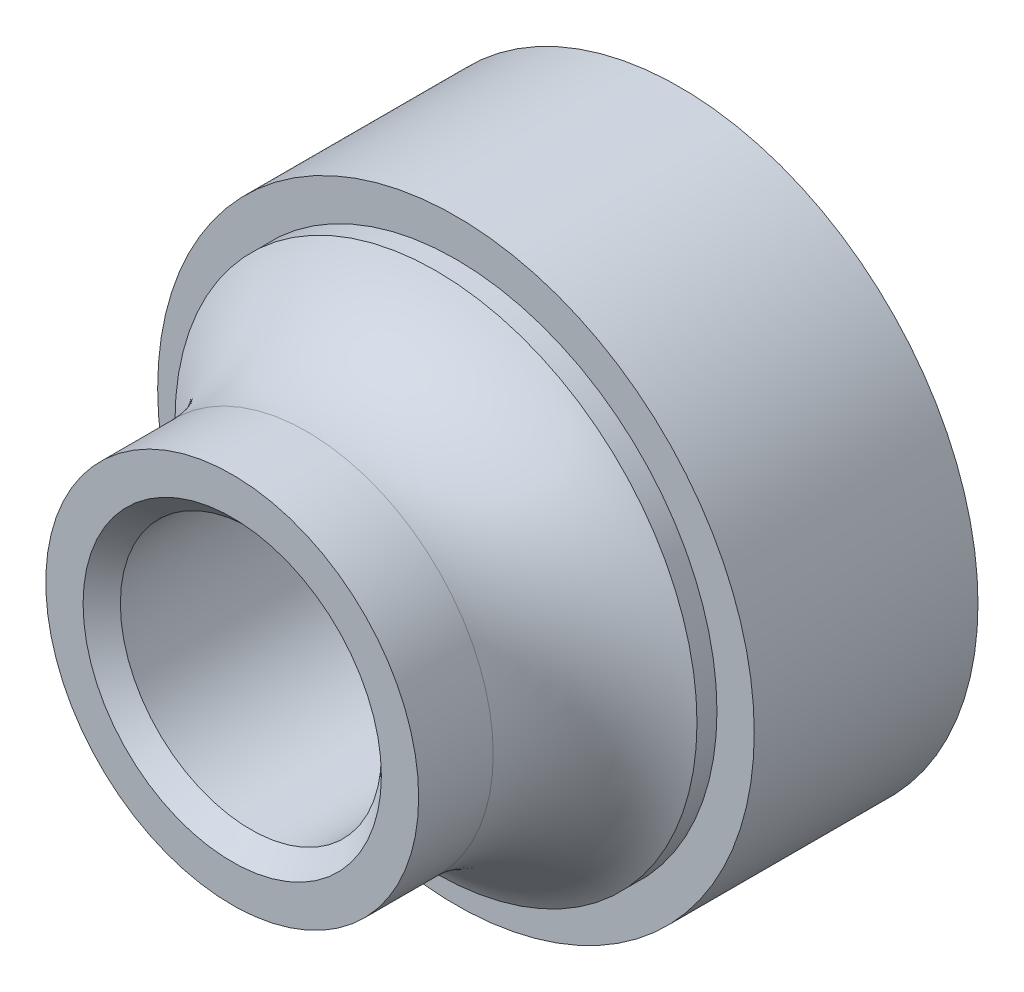
ISO-10303-21;
HEADER;
FILE_DESCRIPTION(('STEP AP214'),'2;1');
FILE_NAME('part.step','',(''),(''),'','','');
FILE_SCHEMA(('AUTOMOTIVE_DESIGN { 1 0 10303 214 1 1 1 1 }'));
ENDSEC;
DATA;
#1=APPLICATION_CONTEXT('core data for automotive mechanical design processes');
#2=APPLICATION_PROTOCOL_DEFINITION('international standard','automotive_design',2000,#1);
#3=PRODUCT_CONTEXT('',#1,'mechanical');
#4=PRODUCT('Part','Part','',(#3));
#5=PRODUCT_RELATED_PRODUCT_CATEGORY('part','',(#4));
#6=PRODUCT_DEFINITION_FORMATION('','',#4);
#7=PRODUCT_DEFINITION_CONTEXT('part definition',#1,'design');
#8=PRODUCT_DEFINITION('design','',#6,#7);
#9=PRODUCT_DEFINITION_SHAPE('','',#8);
#10=(LENGTH_UNIT() NAMED_UNIT(*) SI_UNIT(.MILLI.,.METRE.));
#11=(NAMED_UNIT(*) PLANE_ANGLE_UNIT() SI_UNIT($,.RADIAN.));
#12=(NAMED_UNIT(*) SI_UNIT($,.STERADIAN.) SOLID_ANGLE_UNIT());
#13=UNCERTAINTY_MEASURE_WITH_UNIT(LENGTH_MEASURE(1.E-05),#10,'distance_accuracy_value','');
#14=(GEOMETRIC_REPRESENTATION_CONTEXT(3) GLOBAL_UNCERTAINTY_ASSIGNED_CONTEXT((#13)) GLOBAL_UNIT_ASSIGNED_CONTEXT((#10,
#11,#12)) REPRESENTATION_CONTEXT('',''));
#15=CARTESIAN_POINT('',(0.,0.,0.));
#16=DIRECTION('',(0.,0.,1.));
#17=DIRECTION('',(1.,0.,0.));
#18=AXIS2_PLACEMENT_3D('',#15,#16,#17);
#19=CARTESIAN_POINT('',(0.,0.,12.));
#20=DIRECTION('',(0.,0.,-1.));
#21=DIRECTION('',(-1.,0.,0.));
#22=AXIS2_PLACEMENT_3D('',#19,#20,#21);
#23=CYLINDRICAL_SURFACE('',#22,7.);
#24=CARTESIAN_POINT('',(0.,0.,6.));
#25=DIRECTION('',(0.,0.,1.));
#26=DIRECTION('',(1.,0.,0.));
#27=AXIS2_PLACEMENT_3D('',#24,#25,#26);
#28=CIRCLE('',#27,7.);
#29=CARTESIAN_POINT('',(7.,0.,6.));
#30=VERTEX_POINT('',#29);
#31=EDGE_CURVE('E53',#30,#30,#28,.T.);
#32=ORIENTED_EDGE('',*,*,#31,.T.);
#33=EDGE_LOOP('',(#32));
#34=FACE_BOUND('',#33,.T.);
#35=CARTESIAN_POINT('',(0.,0.,6.53589838486224));
#36=DIRECTION('',(0.,0.,1.));
#37=DIRECTION('',(1.,0.,0.));
#38=AXIS2_PLACEMENT_3D('',#35,#36,#37);
#39=CIRCLE('',#38,7.);
#40=CARTESIAN_POINT('',(7.,0.,6.53589838486224));
#41=VERTEX_POINT('',#40);
#42=EDGE_CURVE('E56',#41,#41,#39,.T.);
#43=ORIENTED_EDGE('',*,*,#42,.F.);
#44=EDGE_LOOP('',(#43));
#45=FACE_BOUND('',#44,.T.);
#46=ADVANCED_FACE('F27',(#34,#45),#23,.T.);
#47=CARTESIAN_POINT('',(0.,0.,6.));
#48=DIRECTION('',(0.,0.,1.));
#49=DIRECTION('',(1.,0.,0.));
#50=AXIS2_PLACEMENT_3D('',#47,#48,#49);
#51=PLANE('',#50);
#52=CARTESIAN_POINT('',(0.,0.,6.));
#53=DIRECTION('',(0.,0.,1.));
#54=DIRECTION('',(1.,0.,0.));
#55=AXIS2_PLACEMENT_3D('',#52,#53,#54);
#56=CIRCLE('',#55,8.);
#57=CARTESIAN_POINT('',(8.,0.,6.));
#58=VERTEX_POINT('',#57);
#59=EDGE_CURVE('E47',#58,#58,#56,.T.);
#60=ORIENTED_EDGE('',*,*,#59,.T.);
#61=EDGE_LOOP('',(#60));
#62=FACE_BOUND('',#61,.T.);
#63=ORIENTED_EDGE('',*,*,#31,.F.);
#64=EDGE_LOOP('',(#63));
#65=FACE_BOUND('',#64,.T.);
#66=ADVANCED_FACE('F83',(#62,#65),#51,.T.);
#67=CARTESIAN_POINT('',(0.,0.,6.));
#68=DIRECTION('',(0.,0.,-1.));
#69=DIRECTION('',(-1.,0.,0.));
#70=AXIS2_PLACEMENT_3D('',#67,#68,#69);
#71=CYLINDRICAL_SURFACE('',#70,8.);
#72=ORIENTED_EDGE('',*,*,#59,.F.);
#73=EDGE_LOOP('',(#72));
#74=FACE_BOUND('',#73,.T.);
#75=CARTESIAN_POINT('',(0.,0.,0.));
#76=DIRECTION('',(0.,0.,1.));
#77=DIRECTION('',(1.,0.,0.));
#78=AXIS2_PLACEMENT_3D('',#75,#76,#77);
#79=CIRCLE('',#78,8.);
#80=CARTESIAN_POINT('',(8.,0.,0.));
#81=VERTEX_POINT('',#80);
#82=EDGE_CURVE('E50',#81,#81,#79,.T.);
#83=ORIENTED_EDGE('',*,*,#82,.T.);
#84=EDGE_LOOP('',(#83));
#85=FACE_BOUND('',#84,.T.);
#86=ADVANCED_FACE('F29',(#74,#85),#71,.T.);
#87=CARTESIAN_POINT('',(0.,0.,0.));
#88=DIRECTION('',(0.,0.,1.));
#89=DIRECTION('',(1.,0.,0.));
#90=AXIS2_PLACEMENT_3D('',#87,#88,#89);
#91=PLANE('',#90);
#92=CARTESIAN_POINT('',(0.,0.,0.));
#93=DIRECTION('',(0.,0.,1.));
#94=DIRECTION('',(1.,0.,0.));
#95=AXIS2_PLACEMENT_3D('',#92,#93,#94);
#96=CIRCLE('',#95,4.);
#97=CARTESIAN_POINT('',(4.,0.,0.));
#98=VERTEX_POINT('',#97);
#99=EDGE_CURVE('E10',#98,#98,#96,.T.);
#100=ORIENTED_EDGE('',*,*,#99,.T.);
#101=EDGE_LOOP('',(#100));
#102=FACE_BOUND('',#101,.T.);
#103=ORIENTED_EDGE('',*,*,#82,.F.);
#104=EDGE_LOOP('',(#103));
#105=FACE_BOUND('',#104,.T.);
#106=ADVANCED_FACE('F71',(#102,#105),#91,.F.);
#107=CARTESIAN_POINT('',(0.,0.,10.));
#108=DIRECTION('',(0.,0.,1.));
#109=DIRECTION('',(1.,0.,0.));
#110=AXIS2_PLACEMENT_3D('',#107,#108,#109);
#111=TOROIDAL_SURFACE('',#110,9.,4.);
#112=ORIENTED_EDGE('',*,*,#42,.T.);
#113=EDGE_LOOP('',(#112));
#114=FACE_BOUND('',#113,.T.);
#115=CARTESIAN_POINT('',(0.,0.,10.));
#116=DIRECTION('',(0.,0.,1.));
#117=DIRECTION('',(1.,0.,0.));
#118=AXIS2_PLACEMENT_3D('',#115,#116,#117);
#119=CIRCLE('',#118,5.);
#120=CARTESIAN_POINT('',(5.,0.,10.));
#121=VERTEX_POINT('',#120);
#122=EDGE_CURVE('E62',#121,#121,#119,.T.);
#123=ORIENTED_EDGE('',*,*,#122,.F.);
#124=EDGE_LOOP('',(#123));
#125=FACE_BOUND('',#124,.T.);
#126=ADVANCED_FACE('F69',(#114,#125),#111,.F.);
#127=CARTESIAN_POINT('',(0.,0.,12.));
#128=DIRECTION('',(0.,0.,1.));
#129=DIRECTION('',(1.,0.,0.));
#130=AXIS2_PLACEMENT_3D('',#127,#128,#129);
#131=CYLINDRICAL_SURFACE('',#130,5.);
#132=ORIENTED_EDGE('',*,*,#122,.T.);
#133=EDGE_LOOP('',(#132));
#134=FACE_BOUND('',#133,.T.);
#135=CARTESIAN_POINT('',(0.,0.,12.));
#136=DIRECTION('',(0.,0.,1.));
#137=DIRECTION('',(1.,0.,0.));
#138=AXIS2_PLACEMENT_3D('',#135,#136,#137);
#139=CIRCLE('',#138,5.);
#140=CARTESIAN_POINT('',(5.,0.,12.));
#141=VERTEX_POINT('',#140);
#142=EDGE_CURVE('E59',#141,#141,#139,.T.);
#143=ORIENTED_EDGE('',*,*,#142,.F.);
#144=EDGE_LOOP('',(#143));
#145=FACE_BOUND('',#144,.T.);
#146=ADVANCED_FACE('F66',(#134,#145),#131,.T.);
#147=CARTESIAN_POINT('',(0.,0.,12.));
#148=DIRECTION('',(0.,0.,1.));
#149=DIRECTION('',(1.,0.,0.));
#150=AXIS2_PLACEMENT_3D('',#147,#148,#149);
#151=PLANE('',#150);
#152=CARTESIAN_POINT('',(0.,0.,12.));
#153=DIRECTION('',(0.,0.,1.));
#154=DIRECTION('',(1.,0.,0.));
#155=AXIS2_PLACEMENT_3D('',#152,#153,#154);
#156=CIRCLE('',#155,4.00000000000001);
#157=CARTESIAN_POINT('',(4.00000000000001,0.,12.));
#158=VERTEX_POINT('',#157);
#159=EDGE_CURVE('E34',#158,#158,#156,.F.);
#160=ORIENTED_EDGE('',*,*,#159,.T.);
#161=EDGE_LOOP('',(#160));
#162=FACE_BOUND('',#161,.T.);
#163=ORIENTED_EDGE('',*,*,#142,.T.);
#164=EDGE_LOOP('',(#163));
#165=FACE_BOUND('',#164,.T.);
#166=ADVANCED_FACE('F78',(#162,#165),#151,.T.);
#167=CARTESIAN_POINT('',(0.,0.,96.));
#168=DIRECTION('',(0.,0.,-1.));
#169=DIRECTION('',(-1.,0.,0.));
#170=AXIS2_PLACEMENT_3D('',#167,#168,#169);
#171=CYLINDRICAL_SURFACE('',#170,3.5);
#172=CARTESIAN_POINT('',(0.,0.,11.5));
#173=DIRECTION('',(0.,0.,1.));
#174=DIRECTION('',(1.,0.,0.));
#175=AXIS2_PLACEMENT_3D('',#172,#173,#174);
#176=CIRCLE('',#175,3.5);
#177=CARTESIAN_POINT('',(3.5,0.,11.5));
#178=VERTEX_POINT('',#177);
#179=EDGE_CURVE('E38',#178,#178,#176,.T.);
#180=ORIENTED_EDGE('',*,*,#179,.T.);
#181=EDGE_LOOP('',(#180));
#182=FACE_BOUND('',#181,.T.);
#183=CARTESIAN_POINT('',(0.,0.,0.5));
#184=DIRECTION('',(0.,0.,1.));
#185=DIRECTION('',(1.,0.,0.));
#186=AXIS2_PLACEMENT_3D('',#183,#184,#185);
#187=CIRCLE('',#186,3.5);
#188=CARTESIAN_POINT('',(3.5,0.,0.5));
#189=VERTEX_POINT('',#188);
#190=EDGE_CURVE('E42',#189,#189,#187,.F.);
#191=ORIENTED_EDGE('',*,*,#190,.T.);
#192=EDGE_LOOP('',(#191));
#193=FACE_BOUND('',#192,.T.);
#194=ADVANCED_FACE('F92',(#182,#193),#171,.F.);
#195=CARTESIAN_POINT('',(0.,0.,11.5));
#196=DIRECTION('',(0.,0.,1.));
#197=DIRECTION('',(1.,0.,0.));
#198=AXIS2_PLACEMENT_3D('',#195,#196,#197);
#199=CONICAL_SURFACE('',#198,3.5,0.785398163397455);
#200=ORIENTED_EDGE('',*,*,#159,.F.);
#201=EDGE_LOOP('',(#200));
#202=FACE_BOUND('',#201,.T.);
#203=ORIENTED_EDGE('',*,*,#179,.F.);
#204=EDGE_LOOP('',(#203));
#205=FACE_BOUND('',#204,.T.);
#206=ADVANCED_FACE('F96',(#202,#205),#199,.F.);
#207=CARTESIAN_POINT('',(0.,0.,0.5));
#208=DIRECTION('',(0.,0.,-1.));
#209=DIRECTION('',(-1.,0.,0.));
#210=AXIS2_PLACEMENT_3D('',#207,#208,#209);
#211=CONICAL_SURFACE('',#210,3.5,0.785398163397444);
#212=ORIENTED_EDGE('',*,*,#99,.F.);
#213=EDGE_LOOP('',(#212));
#214=FACE_BOUND('',#213,.T.);
#215=ORIENTED_EDGE('',*,*,#190,.F.);
#216=EDGE_LOOP('',(#215));
#217=FACE_BOUND('',#216,.T.);
#218=ADVANCED_FACE('F104',(#214,#217),#211,.F.);
#219=CLOSED_SHELL('',(#46,#66,#86,#106,#126,#146,#166,#194,#206,#218));
#220=MANIFOLD_SOLID_BREP('B2',#219);
#221=ADVANCED_BREP_SHAPE_REPRESENTATION('',(#18,#220),#14);
#222=SHAPE_DEFINITION_REPRESENTATION(#9,#221);
ENDSEC;
END-ISO-10303-21;
